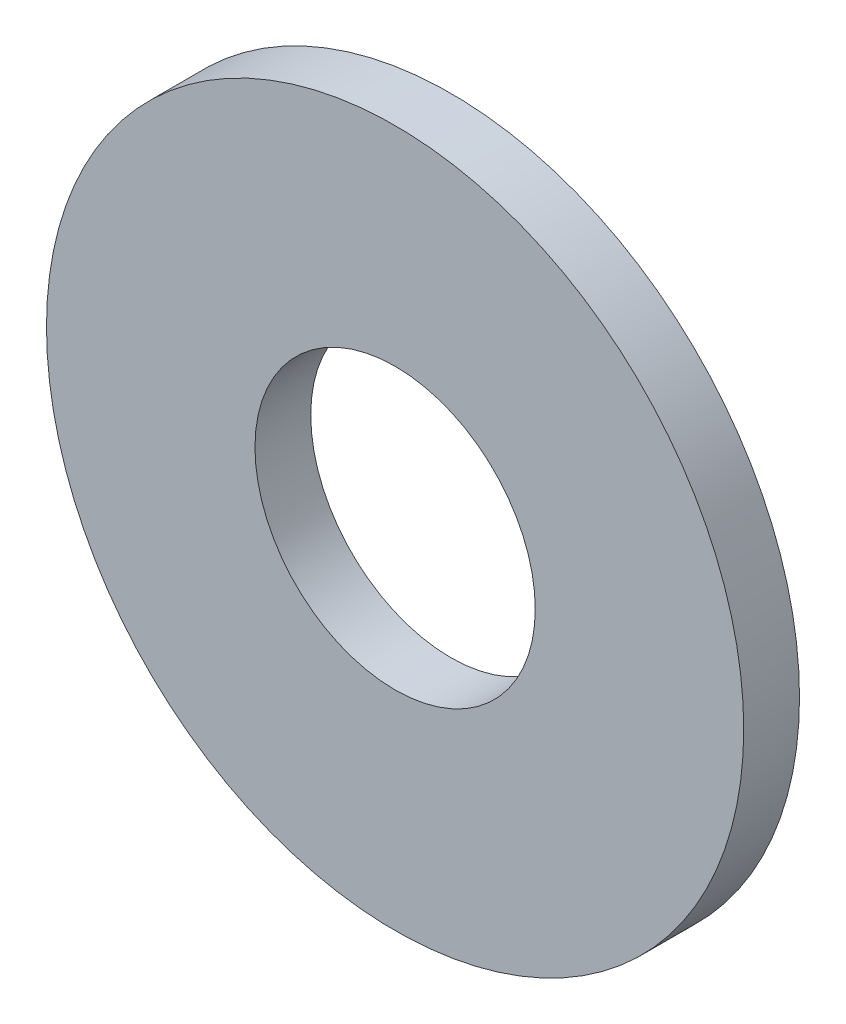
ISO-10303-21;
HEADER;
FILE_DESCRIPTION(('STEP AP214'),'2;1');
FILE_NAME('part.step','',(''),(''),'','','');
FILE_SCHEMA(('AUTOMOTIVE_DESIGN { 1 0 10303 214 1 1 1 1 }'));
ENDSEC;
DATA;
#1=APPLICATION_CONTEXT('core data for automotive mechanical design processes');
#2=APPLICATION_PROTOCOL_DEFINITION('international standard','automotive_design',2000,#1);
#3=PRODUCT_CONTEXT('',#1,'mechanical');
#4=PRODUCT('Part','Part','',(#3));
#5=PRODUCT_RELATED_PRODUCT_CATEGORY('part','',(#4));
#6=PRODUCT_DEFINITION_FORMATION('','',#4);
#7=PRODUCT_DEFINITION_CONTEXT('part definition',#1,'design');
#8=PRODUCT_DEFINITION('design','',#6,#7);
#9=PRODUCT_DEFINITION_SHAPE('','',#8);
#10=(LENGTH_UNIT() NAMED_UNIT(*) SI_UNIT(.MILLI.,.METRE.));
#11=(NAMED_UNIT(*) PLANE_ANGLE_UNIT() SI_UNIT($,.RADIAN.));
#12=(NAMED_UNIT(*) SI_UNIT($,.STERADIAN.) SOLID_ANGLE_UNIT());
#13=UNCERTAINTY_MEASURE_WITH_UNIT(LENGTH_MEASURE(1.E-05),#10,'distance_accuracy_value','');
#14=(GEOMETRIC_REPRESENTATION_CONTEXT(3) GLOBAL_UNCERTAINTY_ASSIGNED_CONTEXT((#13)) GLOBAL_UNIT_ASSIGNED_CONTEXT((#10,
#11,#12)) REPRESENTATION_CONTEXT('',''));
#15=CARTESIAN_POINT('',(0.,0.,0.));
#16=DIRECTION('',(0.,0.,1.));
#17=DIRECTION('',(1.,0.,0.));
#18=AXIS2_PLACEMENT_3D('',#15,#16,#17);
#19=CARTESIAN_POINT('',(0.,0.,1.016));
#20=DIRECTION('',(0.,0.,1.));
#21=DIRECTION('',(1.,0.,0.));
#22=AXIS2_PLACEMENT_3D('',#19,#20,#21);
#23=PLANE('',#22);
#24=CARTESIAN_POINT('',(0.,0.,1.016));
#25=DIRECTION('',(0.,0.,1.));
#26=DIRECTION('',(1.,0.,0.));
#27=AXIS2_PLACEMENT_3D('',#24,#25,#26);
#28=CIRCLE('',#27,6.35);
#29=CARTESIAN_POINT('',(6.35,0.,1.016));
#30=VERTEX_POINT('',#29);
#31=EDGE_CURVE('E10',#30,#30,#28,.T.);
#32=ORIENTED_EDGE('',*,*,#31,.T.);
#33=EDGE_LOOP('',(#32));
#34=FACE_BOUND('',#33,.T.);
#35=CARTESIAN_POINT('',(0.,0.,1.016));
#36=DIRECTION('',(0.,0.,1.));
#37=DIRECTION('',(1.,0.,0.));
#38=AXIS2_PLACEMENT_3D('',#35,#36,#37);
#39=CIRCLE('',#38,2.5527);
#40=CARTESIAN_POINT('',(2.5527,0.,1.016));
#41=VERTEX_POINT('',#40);
#42=EDGE_CURVE('E42',#41,#41,#39,.T.);
#43=ORIENTED_EDGE('',*,*,#42,.F.);
#44=EDGE_LOOP('',(#43));
#45=FACE_BOUND('',#44,.T.);
#46=ADVANCED_FACE('F31',(#34,#45),#23,.T.);
#47=CARTESIAN_POINT('',(0.,0.,0.));
#48=DIRECTION('',(0.,0.,1.));
#49=DIRECTION('',(1.,0.,0.));
#50=AXIS2_PLACEMENT_3D('',#47,#48,#49);
#51=PLANE('',#50);
#52=CARTESIAN_POINT('',(0.,0.,0.));
#53=DIRECTION('',(0.,0.,1.));
#54=DIRECTION('',(1.,0.,0.));
#55=AXIS2_PLACEMENT_3D('',#52,#53,#54);
#56=CIRCLE('',#55,6.35);
#57=CARTESIAN_POINT('',(6.35,0.,0.));
#58=VERTEX_POINT('',#57);
#59=EDGE_CURVE('E35',#58,#58,#56,.T.);
#60=ORIENTED_EDGE('',*,*,#59,.F.);
#61=EDGE_LOOP('',(#60));
#62=FACE_BOUND('',#61,.T.);
#63=CARTESIAN_POINT('',(0.,0.,0.));
#64=DIRECTION('',(0.,0.,1.));
#65=DIRECTION('',(1.,0.,0.));
#66=AXIS2_PLACEMENT_3D('',#63,#64,#65);
#67=CIRCLE('',#66,2.5527);
#68=CARTESIAN_POINT('',(2.5527,0.,0.));
#69=VERTEX_POINT('',#68);
#70=EDGE_CURVE('E44',#69,#69,#67,.T.);
#71=ORIENTED_EDGE('',*,*,#70,.T.);
#72=EDGE_LOOP('',(#71));
#73=FACE_BOUND('',#72,.T.);
#74=ADVANCED_FACE('F54',(#62,#73),#51,.F.);
#75=CARTESIAN_POINT('',(0.,0.,1.016));
#76=DIRECTION('',(0.,0.,-1.));
#77=DIRECTION('',(-1.,0.,0.));
#78=AXIS2_PLACEMENT_3D('',#75,#76,#77);
#79=CYLINDRICAL_SURFACE('',#78,6.35);
#80=ORIENTED_EDGE('',*,*,#31,.F.);
#81=EDGE_LOOP('',(#80));
#82=FACE_BOUND('',#81,.T.);
#83=ORIENTED_EDGE('',*,*,#59,.T.);
#84=EDGE_LOOP('',(#83));
#85=FACE_BOUND('',#84,.T.);
#86=ADVANCED_FACE('F33',(#82,#85),#79,.T.);
#87=CARTESIAN_POINT('',(0.,0.,1.016));
#88=DIRECTION('',(0.,0.,-1.));
#89=DIRECTION('',(-1.,0.,0.));
#90=AXIS2_PLACEMENT_3D('',#87,#88,#89);
#91=CYLINDRICAL_SURFACE('',#90,2.5527);
#92=ORIENTED_EDGE('',*,*,#42,.T.);
#93=EDGE_LOOP('',(#92));
#94=FACE_BOUND('',#93,.T.);
#95=ORIENTED_EDGE('',*,*,#70,.F.);
#96=EDGE_LOOP('',(#95));
#97=FACE_BOUND('',#96,.T.);
#98=ADVANCED_FACE('F50',(#94,#97),#91,.F.);
#99=CLOSED_SHELL('',(#46,#74,#86,#98));
#100=MANIFOLD_SOLID_BREP('B2',#99);
#101=ADVANCED_BREP_SHAPE_REPRESENTATION('',(#18,#100),#14);
#102=SHAPE_DEFINITION_REPRESENTATION(#9,#101);
ENDSEC;
END-ISO-10303-21;
